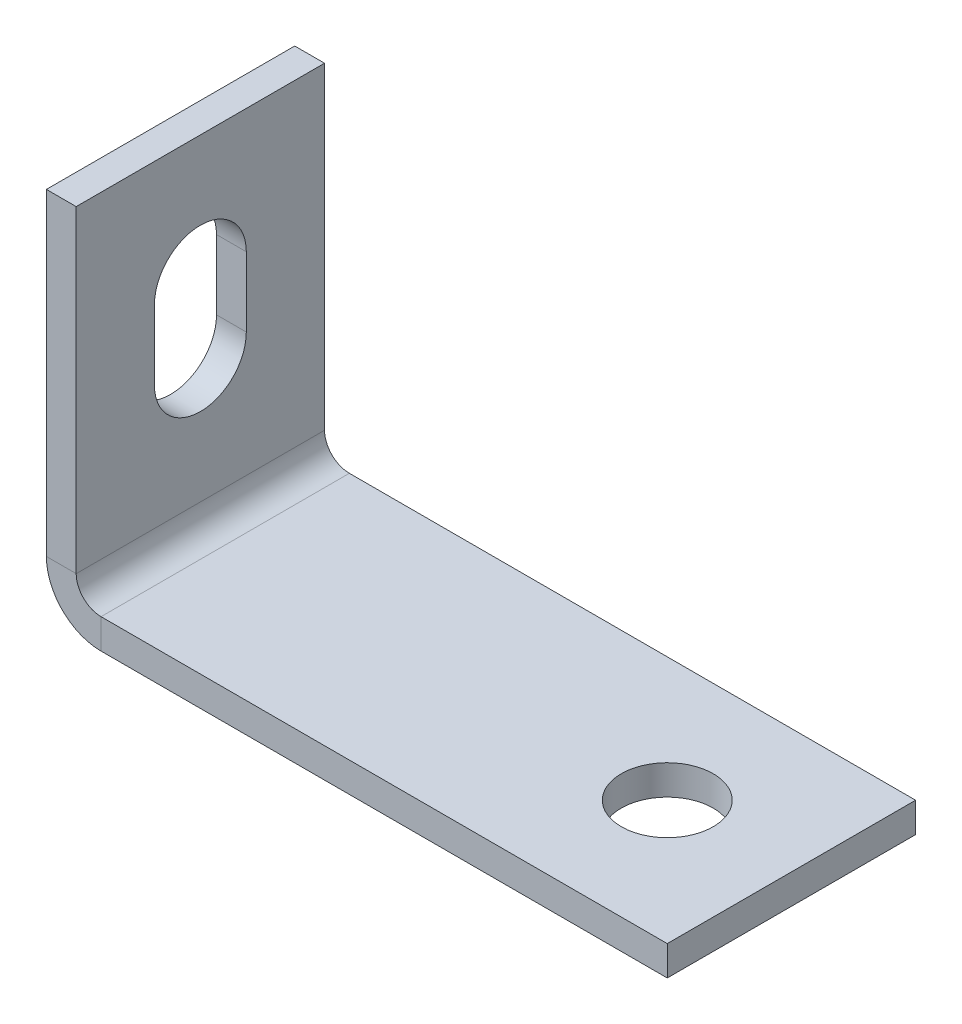
ISO-10303-21;
HEADER;
FILE_DESCRIPTION(('STEP AP214'),'2;1');
FILE_NAME('part.step','',(''),(''),'','','');
FILE_SCHEMA(('AUTOMOTIVE_DESIGN { 1 0 10303 214 1 1 1 1 }'));
ENDSEC;
DATA;
#1=APPLICATION_CONTEXT('core data for automotive mechanical design processes');
#2=APPLICATION_PROTOCOL_DEFINITION('international standard','automotive_design',2000,#1);
#3=PRODUCT_CONTEXT('',#1,'mechanical');
#4=PRODUCT('Part','Part','',(#3));
#5=PRODUCT_RELATED_PRODUCT_CATEGORY('part','',(#4));
#6=PRODUCT_DEFINITION_FORMATION('','',#4);
#7=PRODUCT_DEFINITION_CONTEXT('part definition',#1,'design');
#8=PRODUCT_DEFINITION('design','',#6,#7);
#9=PRODUCT_DEFINITION_SHAPE('','',#8);
#10=(LENGTH_UNIT() NAMED_UNIT(*) SI_UNIT(.MILLI.,.METRE.));
#11=(NAMED_UNIT(*) PLANE_ANGLE_UNIT() SI_UNIT($,.RADIAN.));
#12=(NAMED_UNIT(*) SI_UNIT($,.STERADIAN.) SOLID_ANGLE_UNIT());
#13=UNCERTAINTY_MEASURE_WITH_UNIT(LENGTH_MEASURE(1.E-05),#10,'distance_accuracy_value','');
#14=(GEOMETRIC_REPRESENTATION_CONTEXT(3) GLOBAL_UNCERTAINTY_ASSIGNED_CONTEXT((#13)) GLOBAL_UNIT_ASSIGNED_CONTEXT((#10,
#11,#12)) REPRESENTATION_CONTEXT('',''));
#15=CARTESIAN_POINT('',(0.,0.,0.));
#16=DIRECTION('',(0.,0.,1.));
#17=DIRECTION('',(1.,0.,0.));
#18=AXIS2_PLACEMENT_3D('',#15,#16,#17);
#19=CARTESIAN_POINT('',(0.,2.2,10.));
#20=DIRECTION('',(0.,0.,1.));
#21=DIRECTION('',(1.,0.,0.));
#22=AXIS2_PLACEMENT_3D('',#19,#20,#21);
#23=PLANE('',#22);
#24=DIRECTION('',(1.,0.,0.));
#25=VECTOR('',#24,1.);
#26=CARTESIAN_POINT('',(0.,2.2,10.));
#27=LINE('',#26,#25);
#28=CARTESIAN_POINT('',(0.,2.2,10.));
#29=VERTEX_POINT('',#28);
#30=CARTESIAN_POINT('',(1.2,2.2,10.));
#31=VERTEX_POINT('',#30);
#32=EDGE_CURVE('E11',#29,#31,#27,.T.);
#33=ORIENTED_EDGE('',*,*,#32,.F.);
#34=CARTESIAN_POINT('',(2.2,2.2,10.));
#35=DIRECTION('',(0.,0.,-1.));
#36=DIRECTION('',(-1.,0.,0.));
#37=AXIS2_PLACEMENT_3D('',#34,#35,#36);
#38=CIRCLE('',#37,2.2);
#39=CARTESIAN_POINT('',(2.2,0.,10.));
#40=VERTEX_POINT('',#39);
#41=EDGE_CURVE('E188',#29,#40,#38,.F.);
#42=ORIENTED_EDGE('',*,*,#41,.T.);
#43=DIRECTION('',(0.,-1.,0.));
#44=VECTOR('',#43,1.);
#45=CARTESIAN_POINT('',(2.2,1.2,10.));
#46=LINE('',#45,#44);
#47=CARTESIAN_POINT('',(2.2,1.2,10.));
#48=VERTEX_POINT('',#47);
#49=EDGE_CURVE('E44',#48,#40,#46,.T.);
#50=ORIENTED_EDGE('',*,*,#49,.F.);
#51=CARTESIAN_POINT('',(2.2,2.2,10.));
#52=DIRECTION('',(0.,0.,1.));
#53=DIRECTION('',(1.,0.,0.));
#54=AXIS2_PLACEMENT_3D('',#51,#52,#53);
#55=CIRCLE('',#54,1.);
#56=EDGE_CURVE('E176',#31,#48,#55,.T.);
#57=ORIENTED_EDGE('',*,*,#56,.F.);
#58=EDGE_LOOP('',(#33,#42,#50,#57));
#59=FACE_BOUND('',#58,.T.);
#60=ADVANCED_FACE('F37',(#59),#23,.T.);
#61=CARTESIAN_POINT('',(2.2,1.2,10.));
#62=DIRECTION('',(0.,0.,1.));
#63=DIRECTION('',(1.,0.,0.));
#64=AXIS2_PLACEMENT_3D('',#61,#62,#63);
#65=PLANE('',#64);
#66=DIRECTION('',(0.,-1.,0.));
#67=VECTOR('',#66,1.);
#68=CARTESIAN_POINT('',(0.,15.,10.));
#69=LINE('',#68,#67);
#70=CARTESIAN_POINT('',(0.,15.,10.));
#71=VERTEX_POINT('',#70);
#72=EDGE_CURVE('E185',#71,#29,#69,.T.);
#73=ORIENTED_EDGE('',*,*,#72,.T.);
#74=ORIENTED_EDGE('',*,*,#32,.T.);
#75=DIRECTION('',(0.,-1.,0.));
#76=VECTOR('',#75,1.);
#77=CARTESIAN_POINT('',(1.2,15.,10.));
#78=LINE('',#77,#76);
#79=CARTESIAN_POINT('',(1.2,15.,10.));
#80=VERTEX_POINT('',#79);
#81=EDGE_CURVE('E179',#80,#31,#78,.T.);
#82=ORIENTED_EDGE('',*,*,#81,.F.);
#83=DIRECTION('',(1.,0.,0.));
#84=VECTOR('',#83,1.);
#85=CARTESIAN_POINT('',(0.,15.,10.));
#86=LINE('',#85,#84);
#87=EDGE_CURVE('E182',#71,#80,#86,.T.);
#88=ORIENTED_EDGE('',*,*,#87,.F.);
#89=EDGE_LOOP('',(#73,#74,#82,#88));
#90=FACE_BOUND('',#89,.T.);
#91=ADVANCED_FACE('F269',(#90),#65,.T.);
#92=CARTESIAN_POINT('',(2.2,0.,0.));
#93=DIRECTION('',(0.,0.,-1.));
#94=DIRECTION('',(-1.,0.,0.));
#95=AXIS2_PLACEMENT_3D('',#92,#93,#94);
#96=PLANE('',#95);
#97=DIRECTION('',(0.,1.,0.));
#98=VECTOR('',#97,1.);
#99=CARTESIAN_POINT('',(2.2,0.,0.));
#100=LINE('',#99,#98);
#101=CARTESIAN_POINT('',(2.2,0.,0.));
#102=VERTEX_POINT('',#101);
#103=CARTESIAN_POINT('',(2.2,1.2,0.));
#104=VERTEX_POINT('',#103);
#105=EDGE_CURVE('E235',#102,#104,#100,.T.);
#106=ORIENTED_EDGE('',*,*,#105,.F.);
#107=CARTESIAN_POINT('',(2.2,2.2,0.));
#108=DIRECTION('',(0.,0.,-1.));
#109=DIRECTION('',(-1.,0.,0.));
#110=AXIS2_PLACEMENT_3D('',#107,#108,#109);
#111=CIRCLE('',#110,2.2);
#112=CARTESIAN_POINT('',(0.,2.2,0.));
#113=VERTEX_POINT('',#112);
#114=EDGE_CURVE('E170',#113,#102,#111,.F.);
#115=ORIENTED_EDGE('',*,*,#114,.F.);
#116=DIRECTION('',(-1.,0.,0.));
#117=VECTOR('',#116,1.);
#118=CARTESIAN_POINT('',(1.2,2.2,0.));
#119=LINE('',#118,#117);
#120=CARTESIAN_POINT('',(1.2,2.2,0.));
#121=VERTEX_POINT('',#120);
#122=EDGE_CURVE('E233',#121,#113,#119,.T.);
#123=ORIENTED_EDGE('',*,*,#122,.F.);
#124=CARTESIAN_POINT('',(2.2,2.2,0.));
#125=DIRECTION('',(0.,0.,1.));
#126=DIRECTION('',(1.,0.,0.));
#127=AXIS2_PLACEMENT_3D('',#124,#125,#126);
#128=CIRCLE('',#127,1.);
#129=EDGE_CURVE('E200',#121,#104,#128,.T.);
#130=ORIENTED_EDGE('',*,*,#129,.T.);
#131=EDGE_LOOP('',(#106,#115,#123,#130));
#132=FACE_BOUND('',#131,.T.);
#133=ADVANCED_FACE('F277',(#132),#96,.T.);
#134=CARTESIAN_POINT('',(1.2,2.2,0.));
#135=DIRECTION('',(0.,0.,-1.));
#136=DIRECTION('',(-1.,0.,0.));
#137=AXIS2_PLACEMENT_3D('',#134,#135,#136);
#138=PLANE('',#137);
#139=DIRECTION('',(1.,0.,0.));
#140=VECTOR('',#139,1.);
#141=CARTESIAN_POINT('',(0.,0.,0.));
#142=LINE('',#141,#140);
#143=CARTESIAN_POINT('',(25.,0.,0.));
#144=VERTEX_POINT('',#143);
#145=EDGE_CURVE('E166',#102,#144,#142,.T.);
#146=ORIENTED_EDGE('',*,*,#145,.F.);
#147=ORIENTED_EDGE('',*,*,#105,.T.);
#148=DIRECTION('',(1.,0.,0.));
#149=VECTOR('',#148,1.);
#150=CARTESIAN_POINT('',(0.,1.2,0.));
#151=LINE('',#150,#149);
#152=CARTESIAN_POINT('',(25.,1.2,0.));
#153=VERTEX_POINT('',#152);
#154=EDGE_CURVE('E197',#104,#153,#151,.T.);
#155=ORIENTED_EDGE('',*,*,#154,.T.);
#156=DIRECTION('',(0.,-1.,0.));
#157=VECTOR('',#156,1.);
#158=CARTESIAN_POINT('',(25.,1.2,0.));
#159=LINE('',#158,#157);
#160=EDGE_CURVE('E194',#153,#144,#159,.T.);
#161=ORIENTED_EDGE('',*,*,#160,.T.);
#162=EDGE_LOOP('',(#146,#147,#155,#161));
#163=FACE_BOUND('',#162,.T.);
#164=ADVANCED_FACE('F279',(#163),#138,.T.);
#165=CARTESIAN_POINT('',(0.,0.,10.));
#166=DIRECTION('',(0.,1.,0.));
#167=DIRECTION('',(0.,0.,1.));
#168=AXIS2_PLACEMENT_3D('',#165,#166,#167);
#169=PLANE('',#168);
#170=CARTESIAN_POINT('',(20.,0.,5.));
#171=DIRECTION('',(0.,1.,0.));
#172=DIRECTION('',(0.,0.,1.));
#173=AXIS2_PLACEMENT_3D('',#170,#171,#172);
#174=CIRCLE('',#173,1.85);
#175=CARTESIAN_POINT('',(20.,0.,6.85));
#176=VERTEX_POINT('',#175);
#177=EDGE_CURVE('E163',#176,#176,#174,.F.);
#178=ORIENTED_EDGE('',*,*,#177,.F.);
#179=EDGE_LOOP('',(#178));
#180=FACE_BOUND('',#179,.T.);
#181=ORIENTED_EDGE('',*,*,#145,.T.);
#182=DIRECTION('',(0.,0.,-1.));
#183=VECTOR('',#182,1.);
#184=CARTESIAN_POINT('',(25.,0.,10.));
#185=LINE('',#184,#183);
#186=CARTESIAN_POINT('',(25.,0.,10.));
#187=VERTEX_POINT('',#186);
#188=EDGE_CURVE('E231',#187,#144,#185,.T.);
#189=ORIENTED_EDGE('',*,*,#188,.F.);
#190=DIRECTION('',(1.,0.,0.));
#191=VECTOR('',#190,1.);
#192=CARTESIAN_POINT('',(0.,0.,10.));
#193=LINE('',#192,#191);
#194=EDGE_CURVE('E167',#40,#187,#193,.T.);
#195=ORIENTED_EDGE('',*,*,#194,.F.);
#196=DIRECTION('',(0.,0.,-1.));
#197=VECTOR('',#196,1.);
#198=CARTESIAN_POINT('',(2.2,0.,10.));
#199=LINE('',#198,#197);
#200=EDGE_CURVE('E191',#40,#102,#199,.T.);
#201=ORIENTED_EDGE('',*,*,#200,.T.);
#202=EDGE_LOOP('',(#181,#189,#195,#201));
#203=FACE_BOUND('',#202,.T.);
#204=ADVANCED_FACE('F252',(#180,#203),#169,.F.);
#205=CARTESIAN_POINT('',(25.,1.2,10.));
#206=DIRECTION('',(1.,0.,0.));
#207=DIRECTION('',(0.,0.,-1.));
#208=AXIS2_PLACEMENT_3D('',#205,#206,#207);
#209=PLANE('',#208);
#210=ORIENTED_EDGE('',*,*,#160,.F.);
#211=DIRECTION('',(0.,0.,-1.));
#212=VECTOR('',#211,1.);
#213=CARTESIAN_POINT('',(25.,1.2,10.));
#214=LINE('',#213,#212);
#215=CARTESIAN_POINT('',(25.,1.2,10.));
#216=VERTEX_POINT('',#215);
#217=EDGE_CURVE('E229',#216,#153,#214,.T.);
#218=ORIENTED_EDGE('',*,*,#217,.F.);
#219=DIRECTION('',(0.,-1.,0.));
#220=VECTOR('',#219,1.);
#221=CARTESIAN_POINT('',(25.,1.2,10.));
#222=LINE('',#221,#220);
#223=EDGE_CURVE('E169',#216,#187,#222,.T.);
#224=ORIENTED_EDGE('',*,*,#223,.T.);
#225=ORIENTED_EDGE('',*,*,#188,.T.);
#226=EDGE_LOOP('',(#210,#218,#224,#225));
#227=FACE_BOUND('',#226,.T.);
#228=ADVANCED_FACE('F255',(#227),#209,.T.);
#229=CARTESIAN_POINT('',(0.,1.2,10.));
#230=DIRECTION('',(0.,1.,0.));
#231=DIRECTION('',(0.,0.,1.));
#232=AXIS2_PLACEMENT_3D('',#229,#230,#231);
#233=PLANE('',#232);
#234=CARTESIAN_POINT('',(20.,1.2,5.));
#235=DIRECTION('',(0.,1.,0.));
#236=DIRECTION('',(0.,0.,1.));
#237=AXIS2_PLACEMENT_3D('',#234,#235,#236);
#238=CIRCLE('',#237,1.85);
#239=CARTESIAN_POINT('',(20.,1.2,6.85));
#240=VERTEX_POINT('',#239);
#241=EDGE_CURVE('E138',#240,#240,#238,.T.);
#242=ORIENTED_EDGE('',*,*,#241,.F.);
#243=EDGE_LOOP('',(#242));
#244=FACE_BOUND('',#243,.T.);
#245=ORIENTED_EDGE('',*,*,#154,.F.);
#246=DIRECTION('',(0.,0.,-1.));
#247=VECTOR('',#246,1.);
#248=CARTESIAN_POINT('',(2.2,1.2,10.));
#249=LINE('',#248,#247);
#250=EDGE_CURVE('E226',#48,#104,#249,.T.);
#251=ORIENTED_EDGE('',*,*,#250,.F.);
#252=DIRECTION('',(1.,0.,0.));
#253=VECTOR('',#252,1.);
#254=CARTESIAN_POINT('',(0.,1.2,10.));
#255=LINE('',#254,#253);
#256=EDGE_CURVE('E173',#48,#216,#255,.T.);
#257=ORIENTED_EDGE('',*,*,#256,.T.);
#258=ORIENTED_EDGE('',*,*,#217,.T.);
#259=EDGE_LOOP('',(#245,#251,#257,#258));
#260=FACE_BOUND('',#259,.T.);
#261=ADVANCED_FACE('F258',(#244,#260),#233,.T.);
#262=CARTESIAN_POINT('',(2.2,2.2,10.));
#263=DIRECTION('',(0.,0.,-1.));
#264=DIRECTION('',(-1.,0.,0.));
#265=AXIS2_PLACEMENT_3D('',#262,#263,#264);
#266=CYLINDRICAL_SURFACE('',#265,1.);
#267=ORIENTED_EDGE('',*,*,#129,.F.);
#268=DIRECTION('',(0.,0.,-1.));
#269=VECTOR('',#268,1.);
#270=CARTESIAN_POINT('',(1.2,2.2,10.));
#271=LINE('',#270,#269);
#272=EDGE_CURVE('E223',#31,#121,#271,.T.);
#273=ORIENTED_EDGE('',*,*,#272,.F.);
#274=ORIENTED_EDGE('',*,*,#56,.T.);
#275=ORIENTED_EDGE('',*,*,#250,.T.);
#276=EDGE_LOOP('',(#267,#273,#274,#275));
#277=FACE_BOUND('',#276,.T.);
#278=ADVANCED_FACE('F261',(#277),#266,.F.);
#279=CARTESIAN_POINT('',(1.2,15.,10.));
#280=DIRECTION('',(1.,0.,0.));
#281=DIRECTION('',(0.,1.,0.));
#282=AXIS2_PLACEMENT_3D('',#279,#280,#281);
#283=PLANE('',#282);
#284=CARTESIAN_POINT('',(1.2,10.,5.));
#285=DIRECTION('',(1.,0.,0.));
#286=DIRECTION('',(0.,1.,0.));
#287=AXIS2_PLACEMENT_3D('',#284,#285,#286);
#288=CIRCLE('',#287,1.85);
#289=CARTESIAN_POINT('',(1.2,10.,3.15));
#290=VERTEX_POINT('',#289);
#291=CARTESIAN_POINT('',(1.2,10.,6.85));
#292=VERTEX_POINT('',#291);
#293=EDGE_CURVE('E51',#290,#292,#288,.T.);
#294=ORIENTED_EDGE('',*,*,#293,.F.);
#295=DIRECTION('',(0.,1.,0.));
#296=VECTOR('',#295,1.);
#297=CARTESIAN_POINT('',(1.2,10.,3.15));
#298=LINE('',#297,#296);
#299=CARTESIAN_POINT('',(1.2,7.2,3.15));
#300=VERTEX_POINT('',#299);
#301=EDGE_CURVE('E132',#300,#290,#298,.T.);
#302=ORIENTED_EDGE('',*,*,#301,.F.);
#303=CARTESIAN_POINT('',(1.2,7.2,5.));
#304=DIRECTION('',(1.,0.,0.));
#305=DIRECTION('',(0.,1.,0.));
#306=AXIS2_PLACEMENT_3D('',#303,#304,#305);
#307=CIRCLE('',#306,1.85);
#308=CARTESIAN_POINT('',(1.2,7.2,6.85));
#309=VERTEX_POINT('',#308);
#310=EDGE_CURVE('E152',#309,#300,#307,.T.);
#311=ORIENTED_EDGE('',*,*,#310,.F.);
#312=DIRECTION('',(0.,-1.,0.));
#313=VECTOR('',#312,1.);
#314=CARTESIAN_POINT('',(1.2,10.,6.85));
#315=LINE('',#314,#313);
#316=EDGE_CURVE('E146',#292,#309,#315,.T.);
#317=ORIENTED_EDGE('',*,*,#316,.F.);
#318=EDGE_LOOP('',(#294,#302,#311,#317));
#319=FACE_BOUND('',#318,.T.);
#320=DIRECTION('',(0.,-1.,0.));
#321=VECTOR('',#320,1.);
#322=CARTESIAN_POINT('',(1.2,15.,0.));
#323=LINE('',#322,#321);
#324=CARTESIAN_POINT('',(1.2,15.,0.));
#325=VERTEX_POINT('',#324);
#326=EDGE_CURVE('E203',#325,#121,#323,.T.);
#327=ORIENTED_EDGE('',*,*,#326,.F.);
#328=DIRECTION('',(0.,0.,-1.));
#329=VECTOR('',#328,1.);
#330=CARTESIAN_POINT('',(1.2,15.,10.));
#331=LINE('',#330,#329);
#332=EDGE_CURVE('E221',#80,#325,#331,.T.);
#333=ORIENTED_EDGE('',*,*,#332,.F.);
#334=ORIENTED_EDGE('',*,*,#81,.T.);
#335=ORIENTED_EDGE('',*,*,#272,.T.);
#336=EDGE_LOOP('',(#327,#333,#334,#335));
#337=FACE_BOUND('',#336,.T.);
#338=ADVANCED_FACE('F266',(#319,#337),#283,.T.);
#339=CARTESIAN_POINT('',(0.,15.,10.));
#340=DIRECTION('',(0.,1.,0.));
#341=DIRECTION('',(0.,0.,1.));
#342=AXIS2_PLACEMENT_3D('',#339,#340,#341);
#343=PLANE('',#342);
#344=DIRECTION('',(1.,0.,0.));
#345=VECTOR('',#344,1.);
#346=CARTESIAN_POINT('',(0.,15.,0.));
#347=LINE('',#346,#345);
#348=CARTESIAN_POINT('',(0.,15.,0.));
#349=VERTEX_POINT('',#348);
#350=EDGE_CURVE('E206',#349,#325,#347,.T.);
#351=ORIENTED_EDGE('',*,*,#350,.F.);
#352=DIRECTION('',(0.,0.,-1.));
#353=VECTOR('',#352,1.);
#354=CARTESIAN_POINT('',(0.,15.,10.));
#355=LINE('',#354,#353);
#356=EDGE_CURVE('E219',#71,#349,#355,.T.);
#357=ORIENTED_EDGE('',*,*,#356,.F.);
#358=ORIENTED_EDGE('',*,*,#87,.T.);
#359=ORIENTED_EDGE('',*,*,#332,.T.);
#360=EDGE_LOOP('',(#351,#357,#358,#359));
#361=FACE_BOUND('',#360,.T.);
#362=ADVANCED_FACE('F272',(#361),#343,.T.);
#363=CARTESIAN_POINT('',(0.,15.,10.));
#364=DIRECTION('',(1.,0.,0.));
#365=DIRECTION('',(0.,1.,0.));
#366=AXIS2_PLACEMENT_3D('',#363,#364,#365);
#367=PLANE('',#366);
#368=DIRECTION('',(0.,-1.,0.));
#369=VECTOR('',#368,1.);
#370=CARTESIAN_POINT('',(0.,10.,3.15));
#371=LINE('',#370,#369);
#372=CARTESIAN_POINT('',(0.,10.,3.15));
#373=VERTEX_POINT('',#372);
#374=CARTESIAN_POINT('',(0.,7.2,3.15));
#375=VERTEX_POINT('',#374);
#376=EDGE_CURVE('E144',#373,#375,#371,.T.);
#377=ORIENTED_EDGE('',*,*,#376,.F.);
#378=CARTESIAN_POINT('',(0.,10.,5.));
#379=DIRECTION('',(1.,0.,0.));
#380=DIRECTION('',(0.,1.,0.));
#381=AXIS2_PLACEMENT_3D('',#378,#379,#380);
#382=CIRCLE('',#381,1.85);
#383=CARTESIAN_POINT('',(0.,10.,6.85));
#384=VERTEX_POINT('',#383);
#385=EDGE_CURVE('E126',#384,#373,#382,.F.);
#386=ORIENTED_EDGE('',*,*,#385,.F.);
#387=DIRECTION('',(0.,1.,0.));
#388=VECTOR('',#387,1.);
#389=CARTESIAN_POINT('',(0.,10.,6.85));
#390=LINE('',#389,#388);
#391=CARTESIAN_POINT('',(0.,7.2,6.85));
#392=VERTEX_POINT('',#391);
#393=EDGE_CURVE('E135',#392,#384,#390,.T.);
#394=ORIENTED_EDGE('',*,*,#393,.F.);
#395=CARTESIAN_POINT('',(0.,7.2,5.));
#396=DIRECTION('',(1.,0.,0.));
#397=DIRECTION('',(0.,1.,0.));
#398=AXIS2_PLACEMENT_3D('',#395,#396,#397);
#399=CIRCLE('',#398,1.85);
#400=EDGE_CURVE('E59',#375,#392,#399,.F.);
#401=ORIENTED_EDGE('',*,*,#400,.F.);
#402=EDGE_LOOP('',(#377,#386,#394,#401));
#403=FACE_BOUND('',#402,.T.);
#404=DIRECTION('',(0.,-1.,0.));
#405=VECTOR('',#404,1.);
#406=CARTESIAN_POINT('',(0.,15.,0.));
#407=LINE('',#406,#405);
#408=EDGE_CURVE('E209',#349,#113,#407,.T.);
#409=ORIENTED_EDGE('',*,*,#408,.T.);
#410=DIRECTION('',(0.,0.,-1.));
#411=VECTOR('',#410,1.);
#412=CARTESIAN_POINT('',(0.,2.2,10.));
#413=LINE('',#412,#411);
#414=EDGE_CURVE('E216',#29,#113,#413,.T.);
#415=ORIENTED_EDGE('',*,*,#414,.F.);
#416=ORIENTED_EDGE('',*,*,#72,.F.);
#417=ORIENTED_EDGE('',*,*,#356,.T.);
#418=EDGE_LOOP('',(#409,#415,#416,#417));
#419=FACE_BOUND('',#418,.T.);
#420=ADVANCED_FACE('F141',(#403,#419),#367,.F.);
#421=CARTESIAN_POINT('',(2.2,2.2,10.));
#422=DIRECTION('',(0.,0.,-1.));
#423=DIRECTION('',(-1.,0.,0.));
#424=AXIS2_PLACEMENT_3D('',#421,#422,#423);
#425=CYLINDRICAL_SURFACE('',#424,2.2);
#426=ORIENTED_EDGE('',*,*,#114,.T.);
#427=ORIENTED_EDGE('',*,*,#200,.F.);
#428=ORIENTED_EDGE('',*,*,#41,.F.);
#429=ORIENTED_EDGE('',*,*,#414,.T.);
#430=EDGE_LOOP('',(#426,#427,#428,#429));
#431=FACE_BOUND('',#430,.T.);
#432=ADVANCED_FACE('F248',(#431),#425,.T.);
#433=CARTESIAN_POINT('',(2.2,2.2,10.));
#434=DIRECTION('',(0.,0.,1.));
#435=DIRECTION('',(1.,0.,0.));
#436=AXIS2_PLACEMENT_3D('',#433,#434,#435);
#437=PLANE('',#436);
#438=ORIENTED_EDGE('',*,*,#194,.T.);
#439=ORIENTED_EDGE('',*,*,#223,.F.);
#440=ORIENTED_EDGE('',*,*,#256,.F.);
#441=ORIENTED_EDGE('',*,*,#49,.T.);
#442=EDGE_LOOP('',(#438,#439,#440,#441));
#443=FACE_BOUND('',#442,.T.);
#444=ADVANCED_FACE('F238',(#443),#437,.T.);
#445=CARTESIAN_POINT('',(2.2,2.2,0.));
#446=DIRECTION('',(0.,0.,1.));
#447=DIRECTION('',(1.,0.,0.));
#448=AXIS2_PLACEMENT_3D('',#445,#446,#447);
#449=PLANE('',#448);
#450=ORIENTED_EDGE('',*,*,#326,.T.);
#451=ORIENTED_EDGE('',*,*,#122,.T.);
#452=ORIENTED_EDGE('',*,*,#408,.F.);
#453=ORIENTED_EDGE('',*,*,#350,.T.);
#454=EDGE_LOOP('',(#450,#451,#452,#453));
#455=FACE_BOUND('',#454,.T.);
#456=ADVANCED_FACE('F357',(#455),#449,.F.);
#457=CARTESIAN_POINT('',(20.,-0.000999999999999916,5.));
#458=DIRECTION('',(0.,1.,0.));
#459=DIRECTION('',(0.,0.,1.));
#460=AXIS2_PLACEMENT_3D('',#457,#458,#459);
#461=CYLINDRICAL_SURFACE('',#460,1.85);
#462=ORIENTED_EDGE('',*,*,#241,.T.);
#463=EDGE_LOOP('',(#462));
#464=FACE_BOUND('',#463,.T.);
#465=ORIENTED_EDGE('',*,*,#177,.T.);
#466=EDGE_LOOP('',(#465));
#467=FACE_BOUND('',#466,.T.);
#468=ADVANCED_FACE('F367',(#464,#467),#461,.F.);
#469=CARTESIAN_POINT('',(-0.00100000000000057,10.,5.));
#470=DIRECTION('',(1.,0.,0.));
#471=DIRECTION('',(0.,1.,0.));
#472=AXIS2_PLACEMENT_3D('',#469,#470,#471);
#473=CYLINDRICAL_SURFACE('',#472,1.85);
#474=ORIENTED_EDGE('',*,*,#385,.T.);
#475=DIRECTION('',(1.,0.,0.));
#476=VECTOR('',#475,1.);
#477=CARTESIAN_POINT('',(-0.00100000000000057,10.,3.15));
#478=LINE('',#477,#476);
#479=EDGE_CURVE('E139',#373,#290,#478,.T.);
#480=ORIENTED_EDGE('',*,*,#479,.T.);
#481=ORIENTED_EDGE('',*,*,#293,.T.);
#482=DIRECTION('',(1.,0.,0.));
#483=VECTOR('',#482,1.);
#484=CARTESIAN_POINT('',(-0.00100000000000057,10.,6.85));
#485=LINE('',#484,#483);
#486=EDGE_CURVE('E122',#384,#292,#485,.T.);
#487=ORIENTED_EDGE('',*,*,#486,.F.);
#488=EDGE_LOOP('',(#474,#480,#481,#487));
#489=FACE_BOUND('',#488,.T.);
#490=ADVANCED_FACE('F124',(#489),#473,.F.);
#491=CARTESIAN_POINT('',(-0.00100000000000057,10.,3.15));
#492=DIRECTION('',(0.,0.,-1.));
#493=DIRECTION('',(-1.,0.,0.));
#494=AXIS2_PLACEMENT_3D('',#491,#492,#493);
#495=PLANE('',#494);
#496=ORIENTED_EDGE('',*,*,#376,.T.);
#497=DIRECTION('',(1.,0.,0.));
#498=VECTOR('',#497,1.);
#499=CARTESIAN_POINT('',(-0.00100000000000078,7.2,3.15));
#500=LINE('',#499,#498);
#501=EDGE_CURVE('E158',#375,#300,#500,.T.);
#502=ORIENTED_EDGE('',*,*,#501,.T.);
#503=ORIENTED_EDGE('',*,*,#301,.T.);
#504=ORIENTED_EDGE('',*,*,#479,.F.);
#505=EDGE_LOOP('',(#496,#502,#503,#504));
#506=FACE_BOUND('',#505,.T.);
#507=ADVANCED_FACE('F417',(#506),#495,.F.);
#508=CARTESIAN_POINT('',(-0.00100000000000078,7.2,5.));
#509=DIRECTION('',(1.,0.,0.));
#510=DIRECTION('',(0.,1.,0.));
#511=AXIS2_PLACEMENT_3D('',#508,#509,#510);
#512=CYLINDRICAL_SURFACE('',#511,1.85);
#513=ORIENTED_EDGE('',*,*,#400,.T.);
#514=DIRECTION('',(1.,0.,0.));
#515=VECTOR('',#514,1.);
#516=CARTESIAN_POINT('',(-0.00100000000000078,7.2,6.85));
#517=LINE('',#516,#515);
#518=EDGE_CURVE('E131',#392,#309,#517,.T.);
#519=ORIENTED_EDGE('',*,*,#518,.T.);
#520=ORIENTED_EDGE('',*,*,#310,.T.);
#521=ORIENTED_EDGE('',*,*,#501,.F.);
#522=EDGE_LOOP('',(#513,#519,#520,#521));
#523=FACE_BOUND('',#522,.T.);
#524=ADVANCED_FACE('F427',(#523),#512,.F.);
#525=CARTESIAN_POINT('',(-0.00100000000000057,10.,6.85));
#526=DIRECTION('',(0.,0.,1.));
#527=DIRECTION('',(1.,0.,0.));
#528=AXIS2_PLACEMENT_3D('',#525,#526,#527);
#529=PLANE('',#528);
#530=ORIENTED_EDGE('',*,*,#393,.T.);
#531=ORIENTED_EDGE('',*,*,#486,.T.);
#532=ORIENTED_EDGE('',*,*,#316,.T.);
#533=ORIENTED_EDGE('',*,*,#518,.F.);
#534=EDGE_LOOP('',(#530,#531,#532,#533));
#535=FACE_BOUND('',#534,.T.);
#536=ADVANCED_FACE('F136',(#535),#529,.F.);
#537=CLOSED_SHELL('',(#60,#91,#133,#164,#204,#228,#261,#278,#338,#362,#420,#432,#444,#456,#468,
#490,#507,#524,#536));
#538=MANIFOLD_SOLID_BREP('B2',#537);
#539=ADVANCED_BREP_SHAPE_REPRESENTATION('',(#18,#538),#14);
#540=SHAPE_DEFINITION_REPRESENTATION(#9,#539);
ENDSEC;
END-ISO-10303-21;
